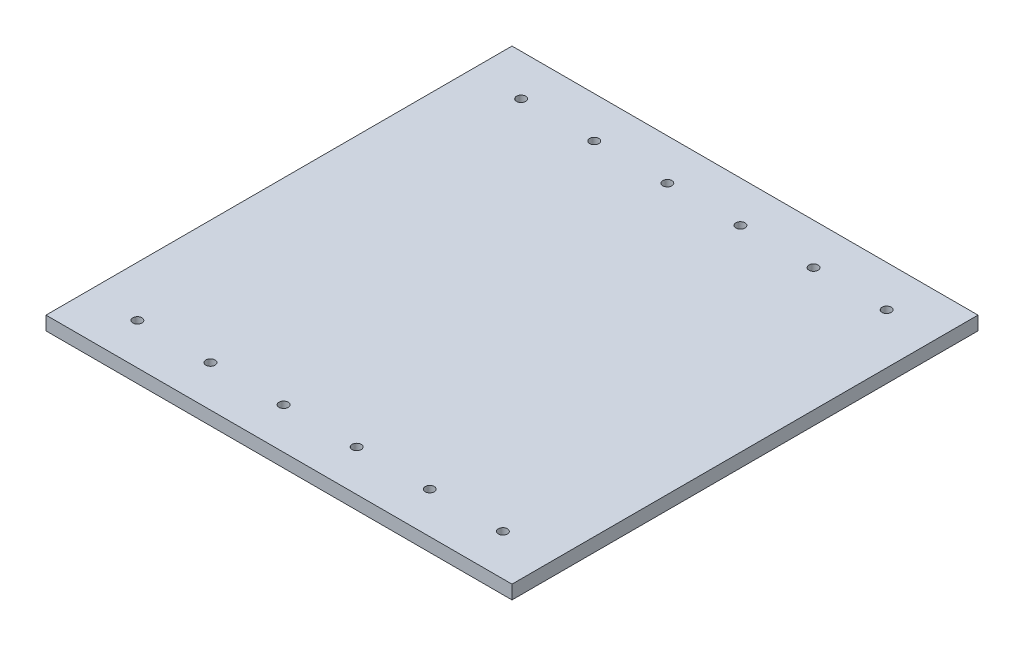
ISO-10303-21;
HEADER;
FILE_DESCRIPTION(('STEP AP214'),'2;1');
FILE_NAME('part.step','',(''),(''),'','','');
FILE_SCHEMA(('AUTOMOTIVE_DESIGN { 1 0 10303 214 1 1 1 1 }'));
ENDSEC;
DATA;
#1=APPLICATION_CONTEXT('core data for automotive mechanical design processes');
#2=APPLICATION_PROTOCOL_DEFINITION('international standard','automotive_design',2000,#1);
#3=PRODUCT_CONTEXT('',#1,'mechanical');
#4=PRODUCT('Part','Part','',(#3));
#5=PRODUCT_RELATED_PRODUCT_CATEGORY('part','',(#4));
#6=PRODUCT_DEFINITION_FORMATION('','',#4);
#7=PRODUCT_DEFINITION_CONTEXT('part definition',#1,'design');
#8=PRODUCT_DEFINITION('design','',#6,#7);
#9=PRODUCT_DEFINITION_SHAPE('','',#8);
#10=(LENGTH_UNIT() NAMED_UNIT(*) SI_UNIT(.MILLI.,.METRE.));
#11=(NAMED_UNIT(*) PLANE_ANGLE_UNIT() SI_UNIT($,.RADIAN.));
#12=(NAMED_UNIT(*) SI_UNIT($,.STERADIAN.) SOLID_ANGLE_UNIT());
#13=UNCERTAINTY_MEASURE_WITH_UNIT(LENGTH_MEASURE(1.E-05),#10,'distance_accuracy_value','');
#14=(GEOMETRIC_REPRESENTATION_CONTEXT(3) GLOBAL_UNCERTAINTY_ASSIGNED_CONTEXT((#13)) GLOBAL_UNIT_ASSIGNED_CONTEXT((#10,
#11,#12)) REPRESENTATION_CONTEXT('',''));
#15=CARTESIAN_POINT('',(0.,0.,0.));
#16=DIRECTION('',(0.,0.,1.));
#17=DIRECTION('',(1.,0.,0.));
#18=AXIS2_PLACEMENT_3D('',#15,#16,#17);
#19=CARTESIAN_POINT('',(0.,19.05,647.7));
#20=DIRECTION('',(0.,1.,0.));
#21=DIRECTION('',(0.,0.,1.));
#22=AXIS2_PLACEMENT_3D('',#19,#20,#21);
#23=PLANE('',#22);
#24=CARTESIAN_POINT('',(476.250000000006,19.05,590.55));
#25=DIRECTION('',(0.,1.,0.));
#26=DIRECTION('',(0.,0.,1.));
#27=AXIS2_PLACEMENT_3D('',#24,#25,#26);
#28=CIRCLE('',#27,6.34999999999999);
#29=CARTESIAN_POINT('',(476.250000000006,19.05,596.9));
#30=VERTEX_POINT('',#29);
#31=EDGE_CURVE('E171',#30,#30,#28,.T.);
#32=ORIENTED_EDGE('',*,*,#31,.F.);
#33=EDGE_LOOP('',(#32));
#34=FACE_BOUND('',#33,.T.);
#35=CARTESIAN_POINT('',(273.050000000006,19.05,590.55));
#36=DIRECTION('',(0.,1.,0.));
#37=DIRECTION('',(0.,0.,1.));
#38=AXIS2_PLACEMENT_3D('',#35,#36,#37);
#39=CIRCLE('',#38,6.34999999999999);
#40=CARTESIAN_POINT('',(273.050000000006,19.05,596.9));
#41=VERTEX_POINT('',#40);
#42=EDGE_CURVE('E159',#41,#41,#39,.T.);
#43=ORIENTED_EDGE('',*,*,#42,.F.);
#44=EDGE_LOOP('',(#43));
#45=FACE_BOUND('',#44,.T.);
#46=CARTESIAN_POINT('',(69.8500000000056,19.05,590.55));
#47=DIRECTION('',(0.,1.,0.));
#48=DIRECTION('',(0.,0.,1.));
#49=AXIS2_PLACEMENT_3D('',#46,#47,#48);
#50=CIRCLE('',#49,6.35000000000001);
#51=CARTESIAN_POINT('',(69.8500000000056,19.05,596.9));
#52=VERTEX_POINT('',#51);
#53=EDGE_CURVE('E147',#52,#52,#50,.T.);
#54=ORIENTED_EDGE('',*,*,#53,.F.);
#55=EDGE_LOOP('',(#54));
#56=FACE_BOUND('',#55,.T.);
#57=CARTESIAN_POINT('',(476.25,19.05,57.15));
#58=DIRECTION('',(0.,1.,0.));
#59=DIRECTION('',(0.,0.,1.));
#60=AXIS2_PLACEMENT_3D('',#57,#58,#59);
#61=CIRCLE('',#60,6.35);
#62=CARTESIAN_POINT('',(476.25,19.05,63.5));
#63=VERTEX_POINT('',#62);
#64=EDGE_CURVE('E135',#63,#63,#61,.T.);
#65=ORIENTED_EDGE('',*,*,#64,.F.);
#66=EDGE_LOOP('',(#65));
#67=FACE_BOUND('',#66,.T.);
#68=CARTESIAN_POINT('',(273.05,19.05,57.15));
#69=DIRECTION('',(0.,1.,0.));
#70=DIRECTION('',(0.,0.,1.));
#71=AXIS2_PLACEMENT_3D('',#68,#69,#70);
#72=CIRCLE('',#71,6.35);
#73=CARTESIAN_POINT('',(273.05,19.05,63.5));
#74=VERTEX_POINT('',#73);
#75=EDGE_CURVE('E123',#74,#74,#72,.T.);
#76=ORIENTED_EDGE('',*,*,#75,.F.);
#77=EDGE_LOOP('',(#76));
#78=FACE_BOUND('',#77,.T.);
#79=CARTESIAN_POINT('',(69.85,19.05,57.15));
#80=DIRECTION('',(0.,1.,0.));
#81=DIRECTION('',(0.,0.,1.));
#82=AXIS2_PLACEMENT_3D('',#79,#80,#81);
#83=CIRCLE('',#82,6.35000000000001);
#84=CARTESIAN_POINT('',(69.85,19.05,63.5));
#85=VERTEX_POINT('',#84);
#86=EDGE_CURVE('E102',#85,#85,#83,.T.);
#87=ORIENTED_EDGE('',*,*,#86,.F.);
#88=EDGE_LOOP('',(#87));
#89=FACE_BOUND('',#88,.T.);
#90=DIRECTION('',(0.,0.,1.));
#91=VECTOR('',#90,1.);
#92=CARTESIAN_POINT('',(0.,19.05,0.));
#93=LINE('',#92,#91);
#94=CARTESIAN_POINT('',(0.,19.05,0.));
#95=VERTEX_POINT('',#94);
#96=CARTESIAN_POINT('',(0.,19.05,647.7));
#97=VERTEX_POINT('',#96);
#98=EDGE_CURVE('E87',#95,#97,#93,.T.);
#99=ORIENTED_EDGE('',*,*,#98,.T.);
#100=DIRECTION('',(1.,0.,0.));
#101=VECTOR('',#100,1.);
#102=CARTESIAN_POINT('',(0.,19.05,647.7));
#103=LINE('',#102,#101);
#104=CARTESIAN_POINT('',(647.7,19.05,647.7));
#105=VERTEX_POINT('',#104);
#106=EDGE_CURVE('E82',#97,#105,#103,.T.);
#107=ORIENTED_EDGE('',*,*,#106,.T.);
#108=DIRECTION('',(0.,0.,-1.));
#109=VECTOR('',#108,1.);
#110=CARTESIAN_POINT('',(647.7,19.05,0.));
#111=LINE('',#110,#109);
#112=CARTESIAN_POINT('',(647.7,19.05,0.));
#113=VERTEX_POINT('',#112);
#114=EDGE_CURVE('E85',#105,#113,#111,.T.);
#115=ORIENTED_EDGE('',*,*,#114,.T.);
#116=DIRECTION('',(-1.,0.,0.));
#117=VECTOR('',#116,1.);
#118=CARTESIAN_POINT('',(0.,19.05,0.));
#119=LINE('',#118,#117);
#120=EDGE_CURVE('E52',#113,#95,#119,.T.);
#121=ORIENTED_EDGE('',*,*,#120,.T.);
#122=EDGE_LOOP('',(#99,#107,#115,#121));
#123=FACE_BOUND('',#122,.T.);
#124=CARTESIAN_POINT('',(171.45,19.05,57.15));
#125=DIRECTION('',(0.,1.,0.));
#126=DIRECTION('',(0.,0.,1.));
#127=AXIS2_PLACEMENT_3D('',#124,#125,#126);
#128=CIRCLE('',#127,6.35000000000002);
#129=CARTESIAN_POINT('',(171.45,19.05,63.5));
#130=VERTEX_POINT('',#129);
#131=EDGE_CURVE('E117',#130,#130,#128,.T.);
#132=ORIENTED_EDGE('',*,*,#131,.F.);
#133=EDGE_LOOP('',(#132));
#134=FACE_BOUND('',#133,.T.);
#135=CARTESIAN_POINT('',(374.65,19.05,57.15));
#136=DIRECTION('',(0.,1.,0.));
#137=DIRECTION('',(0.,0.,1.));
#138=AXIS2_PLACEMENT_3D('',#135,#136,#137);
#139=CIRCLE('',#138,6.35);
#140=CARTESIAN_POINT('',(374.65,19.05,63.5));
#141=VERTEX_POINT('',#140);
#142=EDGE_CURVE('E129',#141,#141,#139,.T.);
#143=ORIENTED_EDGE('',*,*,#142,.F.);
#144=EDGE_LOOP('',(#143));
#145=FACE_BOUND('',#144,.T.);
#146=CARTESIAN_POINT('',(577.85,19.05,57.15));
#147=DIRECTION('',(0.,1.,0.));
#148=DIRECTION('',(0.,0.,1.));
#149=AXIS2_PLACEMENT_3D('',#146,#147,#148);
#150=CIRCLE('',#149,6.35000000000005);
#151=CARTESIAN_POINT('',(577.85,19.05,63.5));
#152=VERTEX_POINT('',#151);
#153=EDGE_CURVE('E141',#152,#152,#150,.T.);
#154=ORIENTED_EDGE('',*,*,#153,.F.);
#155=EDGE_LOOP('',(#154));
#156=FACE_BOUND('',#155,.T.);
#157=CARTESIAN_POINT('',(171.450000000006,19.05,590.55));
#158=DIRECTION('',(0.,1.,0.));
#159=DIRECTION('',(0.,0.,1.));
#160=AXIS2_PLACEMENT_3D('',#157,#158,#159);
#161=CIRCLE('',#160,6.35000000000002);
#162=CARTESIAN_POINT('',(171.450000000006,19.05,596.9));
#163=VERTEX_POINT('',#162);
#164=EDGE_CURVE('E153',#163,#163,#161,.T.);
#165=ORIENTED_EDGE('',*,*,#164,.F.);
#166=EDGE_LOOP('',(#165));
#167=FACE_BOUND('',#166,.T.);
#168=CARTESIAN_POINT('',(374.650000000006,19.05,590.55));
#169=DIRECTION('',(0.,1.,0.));
#170=DIRECTION('',(0.,0.,1.));
#171=AXIS2_PLACEMENT_3D('',#168,#169,#170);
#172=CIRCLE('',#171,6.34999999999999);
#173=CARTESIAN_POINT('',(374.650000000006,19.05,596.9));
#174=VERTEX_POINT('',#173);
#175=EDGE_CURVE('E165',#174,#174,#172,.T.);
#176=ORIENTED_EDGE('',*,*,#175,.F.);
#177=EDGE_LOOP('',(#176));
#178=FACE_BOUND('',#177,.T.);
#179=CARTESIAN_POINT('',(577.850000000005,19.05,590.55));
#180=DIRECTION('',(0.,1.,0.));
#181=DIRECTION('',(0.,0.,1.));
#182=AXIS2_PLACEMENT_3D('',#179,#180,#181);
#183=CIRCLE('',#182,6.35000000000005);
#184=CARTESIAN_POINT('',(577.850000000005,19.05,596.9));
#185=VERTEX_POINT('',#184);
#186=EDGE_CURVE('E177',#185,#185,#183,.T.);
#187=ORIENTED_EDGE('',*,*,#186,.F.);
#188=EDGE_LOOP('',(#187));
#189=FACE_BOUND('',#188,.T.);
#190=ADVANCED_FACE('F35',(#34,#45,#56,#67,#78,#89,#123,#134,#145,#156,#167,#178,#189),#23,.T.);
#191=CARTESIAN_POINT('',(0.,0.,647.7));
#192=DIRECTION('',(0.,1.,0.));
#193=DIRECTION('',(0.,0.,1.));
#194=AXIS2_PLACEMENT_3D('',#191,#192,#193);
#195=PLANE('',#194);
#196=CARTESIAN_POINT('',(476.250000000006,0.,590.55));
#197=DIRECTION('',(0.,1.,0.));
#198=DIRECTION('',(0.,0.,1.));
#199=AXIS2_PLACEMENT_3D('',#196,#197,#198);
#200=CIRCLE('',#199,6.34999999999999);
#201=CARTESIAN_POINT('',(476.250000000006,0.,596.9));
#202=VERTEX_POINT('',#201);
#203=EDGE_CURVE('E174',#202,#202,#200,.T.);
#204=ORIENTED_EDGE('',*,*,#203,.T.);
#205=EDGE_LOOP('',(#204));
#206=FACE_BOUND('',#205,.T.);
#207=CARTESIAN_POINT('',(273.050000000006,0.,590.55));
#208=DIRECTION('',(0.,1.,0.));
#209=DIRECTION('',(0.,0.,1.));
#210=AXIS2_PLACEMENT_3D('',#207,#208,#209);
#211=CIRCLE('',#210,6.34999999999999);
#212=CARTESIAN_POINT('',(273.050000000006,0.,596.9));
#213=VERTEX_POINT('',#212);
#214=EDGE_CURVE('E162',#213,#213,#211,.T.);
#215=ORIENTED_EDGE('',*,*,#214,.T.);
#216=EDGE_LOOP('',(#215));
#217=FACE_BOUND('',#216,.T.);
#218=CARTESIAN_POINT('',(69.8500000000056,0.,590.55));
#219=DIRECTION('',(0.,1.,0.));
#220=DIRECTION('',(0.,0.,1.));
#221=AXIS2_PLACEMENT_3D('',#218,#219,#220);
#222=CIRCLE('',#221,6.35000000000001);
#223=CARTESIAN_POINT('',(69.8500000000056,0.,596.9));
#224=VERTEX_POINT('',#223);
#225=EDGE_CURVE('E150',#224,#224,#222,.T.);
#226=ORIENTED_EDGE('',*,*,#225,.T.);
#227=EDGE_LOOP('',(#226));
#228=FACE_BOUND('',#227,.T.);
#229=CARTESIAN_POINT('',(476.25,0.,57.15));
#230=DIRECTION('',(0.,1.,0.));
#231=DIRECTION('',(0.,0.,1.));
#232=AXIS2_PLACEMENT_3D('',#229,#230,#231);
#233=CIRCLE('',#232,6.35);
#234=CARTESIAN_POINT('',(476.25,0.,63.5));
#235=VERTEX_POINT('',#234);
#236=EDGE_CURVE('E138',#235,#235,#233,.T.);
#237=ORIENTED_EDGE('',*,*,#236,.T.);
#238=EDGE_LOOP('',(#237));
#239=FACE_BOUND('',#238,.T.);
#240=CARTESIAN_POINT('',(273.05,0.,57.15));
#241=DIRECTION('',(0.,1.,0.));
#242=DIRECTION('',(0.,0.,1.));
#243=AXIS2_PLACEMENT_3D('',#240,#241,#242);
#244=CIRCLE('',#243,6.35);
#245=CARTESIAN_POINT('',(273.05,0.,63.5));
#246=VERTEX_POINT('',#245);
#247=EDGE_CURVE('E126',#246,#246,#244,.T.);
#248=ORIENTED_EDGE('',*,*,#247,.T.);
#249=EDGE_LOOP('',(#248));
#250=FACE_BOUND('',#249,.T.);
#251=CARTESIAN_POINT('',(69.85,0.,57.15));
#252=DIRECTION('',(0.,1.,0.));
#253=DIRECTION('',(0.,0.,1.));
#254=AXIS2_PLACEMENT_3D('',#251,#252,#253);
#255=CIRCLE('',#254,6.35000000000001);
#256=CARTESIAN_POINT('',(69.85,0.,63.5));
#257=VERTEX_POINT('',#256);
#258=EDGE_CURVE('E114',#257,#257,#255,.T.);
#259=ORIENTED_EDGE('',*,*,#258,.T.);
#260=EDGE_LOOP('',(#259));
#261=FACE_BOUND('',#260,.T.);
#262=DIRECTION('',(0.,0.,1.));
#263=VECTOR('',#262,1.);
#264=CARTESIAN_POINT('',(0.,0.,0.));
#265=LINE('',#264,#263);
#266=CARTESIAN_POINT('',(0.,0.,0.));
#267=VERTEX_POINT('',#266);
#268=CARTESIAN_POINT('',(0.,0.,647.7));
#269=VERTEX_POINT('',#268);
#270=EDGE_CURVE('E99',#267,#269,#265,.T.);
#271=ORIENTED_EDGE('',*,*,#270,.F.);
#272=DIRECTION('',(-1.,0.,0.));
#273=VECTOR('',#272,1.);
#274=CARTESIAN_POINT('',(0.,0.,0.));
#275=LINE('',#274,#273);
#276=CARTESIAN_POINT('',(647.7,0.,0.));
#277=VERTEX_POINT('',#276);
#278=EDGE_CURVE('E75',#277,#267,#275,.T.);
#279=ORIENTED_EDGE('',*,*,#278,.F.);
#280=DIRECTION('',(0.,0.,-1.));
#281=VECTOR('',#280,1.);
#282=CARTESIAN_POINT('',(647.7,0.,0.));
#283=LINE('',#282,#281);
#284=CARTESIAN_POINT('',(647.7,0.,647.7));
#285=VERTEX_POINT('',#284);
#286=EDGE_CURVE('E69',#285,#277,#283,.T.);
#287=ORIENTED_EDGE('',*,*,#286,.F.);
#288=DIRECTION('',(1.,0.,0.));
#289=VECTOR('',#288,1.);
#290=CARTESIAN_POINT('',(0.,0.,647.7));
#291=LINE('',#290,#289);
#292=EDGE_CURVE('E91',#269,#285,#291,.T.);
#293=ORIENTED_EDGE('',*,*,#292,.F.);
#294=EDGE_LOOP('',(#271,#279,#287,#293));
#295=FACE_BOUND('',#294,.T.);
#296=CARTESIAN_POINT('',(171.45,0.,57.15));
#297=DIRECTION('',(0.,1.,0.));
#298=DIRECTION('',(0.,0.,1.));
#299=AXIS2_PLACEMENT_3D('',#296,#297,#298);
#300=CIRCLE('',#299,6.35000000000002);
#301=CARTESIAN_POINT('',(171.45,0.,63.5));
#302=VERTEX_POINT('',#301);
#303=EDGE_CURVE('E120',#302,#302,#300,.T.);
#304=ORIENTED_EDGE('',*,*,#303,.T.);
#305=EDGE_LOOP('',(#304));
#306=FACE_BOUND('',#305,.T.);
#307=CARTESIAN_POINT('',(374.65,0.,57.15));
#308=DIRECTION('',(0.,1.,0.));
#309=DIRECTION('',(0.,0.,1.));
#310=AXIS2_PLACEMENT_3D('',#307,#308,#309);
#311=CIRCLE('',#310,6.35);
#312=CARTESIAN_POINT('',(374.65,0.,63.5));
#313=VERTEX_POINT('',#312);
#314=EDGE_CURVE('E132',#313,#313,#311,.T.);
#315=ORIENTED_EDGE('',*,*,#314,.T.);
#316=EDGE_LOOP('',(#315));
#317=FACE_BOUND('',#316,.T.);
#318=CARTESIAN_POINT('',(577.85,0.,57.15));
#319=DIRECTION('',(0.,1.,0.));
#320=DIRECTION('',(0.,0.,1.));
#321=AXIS2_PLACEMENT_3D('',#318,#319,#320);
#322=CIRCLE('',#321,6.35000000000005);
#323=CARTESIAN_POINT('',(577.85,0.,63.5));
#324=VERTEX_POINT('',#323);
#325=EDGE_CURVE('E144',#324,#324,#322,.T.);
#326=ORIENTED_EDGE('',*,*,#325,.T.);
#327=EDGE_LOOP('',(#326));
#328=FACE_BOUND('',#327,.T.);
#329=CARTESIAN_POINT('',(171.450000000006,0.,590.55));
#330=DIRECTION('',(0.,1.,0.));
#331=DIRECTION('',(0.,0.,1.));
#332=AXIS2_PLACEMENT_3D('',#329,#330,#331);
#333=CIRCLE('',#332,6.35000000000002);
#334=CARTESIAN_POINT('',(171.450000000006,0.,596.9));
#335=VERTEX_POINT('',#334);
#336=EDGE_CURVE('E156',#335,#335,#333,.T.);
#337=ORIENTED_EDGE('',*,*,#336,.T.);
#338=EDGE_LOOP('',(#337));
#339=FACE_BOUND('',#338,.T.);
#340=CARTESIAN_POINT('',(374.650000000006,0.,590.55));
#341=DIRECTION('',(0.,1.,0.));
#342=DIRECTION('',(0.,0.,1.));
#343=AXIS2_PLACEMENT_3D('',#340,#341,#342);
#344=CIRCLE('',#343,6.34999999999999);
#345=CARTESIAN_POINT('',(374.650000000006,0.,596.9));
#346=VERTEX_POINT('',#345);
#347=EDGE_CURVE('E168',#346,#346,#344,.T.);
#348=ORIENTED_EDGE('',*,*,#347,.T.);
#349=EDGE_LOOP('',(#348));
#350=FACE_BOUND('',#349,.T.);
#351=CARTESIAN_POINT('',(577.850000000005,0.,590.55));
#352=DIRECTION('',(0.,1.,0.));
#353=DIRECTION('',(0.,0.,1.));
#354=AXIS2_PLACEMENT_3D('',#351,#352,#353);
#355=CIRCLE('',#354,6.35000000000005);
#356=CARTESIAN_POINT('',(577.850000000005,0.,596.9));
#357=VERTEX_POINT('',#356);
#358=EDGE_CURVE('E180',#357,#357,#355,.T.);
#359=ORIENTED_EDGE('',*,*,#358,.T.);
#360=EDGE_LOOP('',(#359));
#361=FACE_BOUND('',#360,.T.);
#362=ADVANCED_FACE('F110',(#206,#217,#228,#239,#250,#261,#295,#306,#317,#328,#339,#350,#361),
#195,.F.);
#363=CARTESIAN_POINT('',(0.,19.05,0.));
#364=DIRECTION('',(1.,0.,0.));
#365=DIRECTION('',(0.,0.,-1.));
#366=AXIS2_PLACEMENT_3D('',#363,#364,#365);
#367=PLANE('',#366);
#368=ORIENTED_EDGE('',*,*,#270,.T.);
#369=DIRECTION('',(0.,-1.,0.));
#370=VECTOR('',#369,1.);
#371=CARTESIAN_POINT('',(0.,19.05,647.7));
#372=LINE('',#371,#370);
#373=EDGE_CURVE('E11',#97,#269,#372,.T.);
#374=ORIENTED_EDGE('',*,*,#373,.F.);
#375=ORIENTED_EDGE('',*,*,#98,.F.);
#376=DIRECTION('',(0.,-1.,0.));
#377=VECTOR('',#376,1.);
#378=CARTESIAN_POINT('',(0.,19.05,0.));
#379=LINE('',#378,#377);
#380=EDGE_CURVE('E95',#95,#267,#379,.T.);
#381=ORIENTED_EDGE('',*,*,#380,.T.);
#382=EDGE_LOOP('',(#368,#374,#375,#381));
#383=FACE_BOUND('',#382,.T.);
#384=ADVANCED_FACE('F37',(#383),#367,.F.);
#385=CARTESIAN_POINT('',(0.,19.05,647.7));
#386=DIRECTION('',(0.,0.,-1.));
#387=DIRECTION('',(-1.,0.,0.));
#388=AXIS2_PLACEMENT_3D('',#385,#386,#387);
#389=PLANE('',#388);
#390=ORIENTED_EDGE('',*,*,#292,.T.);
#391=DIRECTION('',(0.,-1.,0.));
#392=VECTOR('',#391,1.);
#393=CARTESIAN_POINT('',(647.7,19.05,647.7));
#394=LINE('',#393,#392);
#395=EDGE_CURVE('E44',#105,#285,#394,.T.);
#396=ORIENTED_EDGE('',*,*,#395,.F.);
#397=ORIENTED_EDGE('',*,*,#106,.F.);
#398=ORIENTED_EDGE('',*,*,#373,.T.);
#399=EDGE_LOOP('',(#390,#396,#397,#398));
#400=FACE_BOUND('',#399,.T.);
#401=ADVANCED_FACE('F90',(#400),#389,.F.);
#402=CARTESIAN_POINT('',(647.7,19.05,0.));
#403=DIRECTION('',(-1.,0.,0.));
#404=DIRECTION('',(0.,0.,1.));
#405=AXIS2_PLACEMENT_3D('',#402,#403,#404);
#406=PLANE('',#405);
#407=ORIENTED_EDGE('',*,*,#286,.T.);
#408=DIRECTION('',(0.,-1.,0.));
#409=VECTOR('',#408,1.);
#410=CARTESIAN_POINT('',(647.7,19.05,0.));
#411=LINE('',#410,#409);
#412=EDGE_CURVE('E92',#113,#277,#411,.T.);
#413=ORIENTED_EDGE('',*,*,#412,.F.);
#414=ORIENTED_EDGE('',*,*,#114,.F.);
#415=ORIENTED_EDGE('',*,*,#395,.T.);
#416=EDGE_LOOP('',(#407,#413,#414,#415));
#417=FACE_BOUND('',#416,.T.);
#418=ADVANCED_FACE('F93',(#417),#406,.F.);
#419=CARTESIAN_POINT('',(0.,19.05,0.));
#420=DIRECTION('',(0.,0.,1.));
#421=DIRECTION('',(1.,0.,0.));
#422=AXIS2_PLACEMENT_3D('',#419,#420,#421);
#423=PLANE('',#422);
#424=ORIENTED_EDGE('',*,*,#278,.T.);
#425=ORIENTED_EDGE('',*,*,#380,.F.);
#426=ORIENTED_EDGE('',*,*,#120,.F.);
#427=ORIENTED_EDGE('',*,*,#412,.T.);
#428=EDGE_LOOP('',(#424,#425,#426,#427));
#429=FACE_BOUND('',#428,.T.);
#430=ADVANCED_FACE('F107',(#429),#423,.F.);
#431=CARTESIAN_POINT('',(69.85,19.05,57.15));
#432=DIRECTION('',(0.,-1.,0.));
#433=DIRECTION('',(0.,0.,-1.));
#434=AXIS2_PLACEMENT_3D('',#431,#432,#433);
#435=CYLINDRICAL_SURFACE('',#434,6.35000000000001);
#436=ORIENTED_EDGE('',*,*,#86,.T.);
#437=EDGE_LOOP('',(#436));
#438=FACE_BOUND('',#437,.T.);
#439=ORIENTED_EDGE('',*,*,#258,.F.);
#440=EDGE_LOOP('',(#439));
#441=FACE_BOUND('',#440,.T.);
#442=ADVANCED_FACE('F200',(#438,#441),#435,.F.);
#443=CARTESIAN_POINT('',(171.45,19.05,57.15));
#444=DIRECTION('',(0.,-1.,0.));
#445=DIRECTION('',(0.,0.,-1.));
#446=AXIS2_PLACEMENT_3D('',#443,#444,#445);
#447=CYLINDRICAL_SURFACE('',#446,6.35000000000002);
#448=ORIENTED_EDGE('',*,*,#131,.T.);
#449=EDGE_LOOP('',(#448));
#450=FACE_BOUND('',#449,.T.);
#451=ORIENTED_EDGE('',*,*,#303,.F.);
#452=EDGE_LOOP('',(#451));
#453=FACE_BOUND('',#452,.T.);
#454=ADVANCED_FACE('F246',(#450,#453),#447,.F.);
#455=CARTESIAN_POINT('',(273.05,19.05,57.15));
#456=DIRECTION('',(0.,-1.,0.));
#457=DIRECTION('',(0.,0.,-1.));
#458=AXIS2_PLACEMENT_3D('',#455,#456,#457);
#459=CYLINDRICAL_SURFACE('',#458,6.35);
#460=ORIENTED_EDGE('',*,*,#75,.T.);
#461=EDGE_LOOP('',(#460));
#462=FACE_BOUND('',#461,.T.);
#463=ORIENTED_EDGE('',*,*,#247,.F.);
#464=EDGE_LOOP('',(#463));
#465=FACE_BOUND('',#464,.T.);
#466=ADVANCED_FACE('F254',(#462,#465),#459,.F.);
#467=CARTESIAN_POINT('',(374.65,19.05,57.15));
#468=DIRECTION('',(0.,-1.,0.));
#469=DIRECTION('',(0.,0.,-1.));
#470=AXIS2_PLACEMENT_3D('',#467,#468,#469);
#471=CYLINDRICAL_SURFACE('',#470,6.35);
#472=ORIENTED_EDGE('',*,*,#142,.T.);
#473=EDGE_LOOP('',(#472));
#474=FACE_BOUND('',#473,.T.);
#475=ORIENTED_EDGE('',*,*,#314,.F.);
#476=EDGE_LOOP('',(#475));
#477=FACE_BOUND('',#476,.T.);
#478=ADVANCED_FACE('F262',(#474,#477),#471,.F.);
#479=CARTESIAN_POINT('',(476.25,19.05,57.15));
#480=DIRECTION('',(0.,-1.,0.));
#481=DIRECTION('',(0.,0.,-1.));
#482=AXIS2_PLACEMENT_3D('',#479,#480,#481);
#483=CYLINDRICAL_SURFACE('',#482,6.35);
#484=ORIENTED_EDGE('',*,*,#64,.T.);
#485=EDGE_LOOP('',(#484));
#486=FACE_BOUND('',#485,.T.);
#487=ORIENTED_EDGE('',*,*,#236,.F.);
#488=EDGE_LOOP('',(#487));
#489=FACE_BOUND('',#488,.T.);
#490=ADVANCED_FACE('F271',(#486,#489),#483,.F.);
#491=CARTESIAN_POINT('',(577.85,19.05,57.15));
#492=DIRECTION('',(0.,-1.,0.));
#493=DIRECTION('',(0.,0.,-1.));
#494=AXIS2_PLACEMENT_3D('',#491,#492,#493);
#495=CYLINDRICAL_SURFACE('',#494,6.35000000000005);
#496=ORIENTED_EDGE('',*,*,#153,.T.);
#497=EDGE_LOOP('',(#496));
#498=FACE_BOUND('',#497,.T.);
#499=ORIENTED_EDGE('',*,*,#325,.F.);
#500=EDGE_LOOP('',(#499));
#501=FACE_BOUND('',#500,.T.);
#502=ADVANCED_FACE('F280',(#498,#501),#495,.F.);
#503=CARTESIAN_POINT('',(69.8500000000056,19.05,590.55));
#504=DIRECTION('',(0.,-1.,0.));
#505=DIRECTION('',(0.,0.,-1.));
#506=AXIS2_PLACEMENT_3D('',#503,#504,#505);
#507=CYLINDRICAL_SURFACE('',#506,6.35000000000001);
#508=ORIENTED_EDGE('',*,*,#53,.T.);
#509=EDGE_LOOP('',(#508));
#510=FACE_BOUND('',#509,.T.);
#511=ORIENTED_EDGE('',*,*,#225,.F.);
#512=EDGE_LOOP('',(#511));
#513=FACE_BOUND('',#512,.T.);
#514=ADVANCED_FACE('F289',(#510,#513),#507,.F.);
#515=CARTESIAN_POINT('',(171.450000000006,19.05,590.55));
#516=DIRECTION('',(0.,-1.,0.));
#517=DIRECTION('',(0.,0.,-1.));
#518=AXIS2_PLACEMENT_3D('',#515,#516,#517);
#519=CYLINDRICAL_SURFACE('',#518,6.35000000000002);
#520=ORIENTED_EDGE('',*,*,#164,.T.);
#521=EDGE_LOOP('',(#520));
#522=FACE_BOUND('',#521,.T.);
#523=ORIENTED_EDGE('',*,*,#336,.F.);
#524=EDGE_LOOP('',(#523));
#525=FACE_BOUND('',#524,.T.);
#526=ADVANCED_FACE('F298',(#522,#525),#519,.F.);
#527=CARTESIAN_POINT('',(273.050000000006,19.05,590.55));
#528=DIRECTION('',(0.,-1.,0.));
#529=DIRECTION('',(0.,0.,-1.));
#530=AXIS2_PLACEMENT_3D('',#527,#528,#529);
#531=CYLINDRICAL_SURFACE('',#530,6.34999999999999);
#532=ORIENTED_EDGE('',*,*,#42,.T.);
#533=EDGE_LOOP('',(#532));
#534=FACE_BOUND('',#533,.T.);
#535=ORIENTED_EDGE('',*,*,#214,.F.);
#536=EDGE_LOOP('',(#535));
#537=FACE_BOUND('',#536,.T.);
#538=ADVANCED_FACE('F307',(#534,#537),#531,.F.);
#539=CARTESIAN_POINT('',(374.650000000006,19.05,590.55));
#540=DIRECTION('',(0.,-1.,0.));
#541=DIRECTION('',(0.,0.,-1.));
#542=AXIS2_PLACEMENT_3D('',#539,#540,#541);
#543=CYLINDRICAL_SURFACE('',#542,6.34999999999999);
#544=ORIENTED_EDGE('',*,*,#175,.T.);
#545=EDGE_LOOP('',(#544));
#546=FACE_BOUND('',#545,.T.);
#547=ORIENTED_EDGE('',*,*,#347,.F.);
#548=EDGE_LOOP('',(#547));
#549=FACE_BOUND('',#548,.T.);
#550=ADVANCED_FACE('F316',(#546,#549),#543,.F.);
#551=CARTESIAN_POINT('',(476.250000000006,19.05,590.55));
#552=DIRECTION('',(0.,-1.,0.));
#553=DIRECTION('',(0.,0.,-1.));
#554=AXIS2_PLACEMENT_3D('',#551,#552,#553);
#555=CYLINDRICAL_SURFACE('',#554,6.34999999999999);
#556=ORIENTED_EDGE('',*,*,#31,.T.);
#557=EDGE_LOOP('',(#556));
#558=FACE_BOUND('',#557,.T.);
#559=ORIENTED_EDGE('',*,*,#203,.F.);
#560=EDGE_LOOP('',(#559));
#561=FACE_BOUND('',#560,.T.);
#562=ADVANCED_FACE('F325',(#558,#561),#555,.F.);
#563=CARTESIAN_POINT('',(577.850000000005,19.05,590.55));
#564=DIRECTION('',(0.,-1.,0.));
#565=DIRECTION('',(0.,0.,-1.));
#566=AXIS2_PLACEMENT_3D('',#563,#564,#565);
#567=CYLINDRICAL_SURFACE('',#566,6.35000000000005);
#568=ORIENTED_EDGE('',*,*,#186,.T.);
#569=EDGE_LOOP('',(#568));
#570=FACE_BOUND('',#569,.T.);
#571=ORIENTED_EDGE('',*,*,#358,.F.);
#572=EDGE_LOOP('',(#571));
#573=FACE_BOUND('',#572,.T.);
#574=ADVANCED_FACE('F186',(#570,#573),#567,.F.);
#575=CLOSED_SHELL('',(#190,#362,#384,#401,#418,#430,#442,#454,#466,#478,#490,#502,#514,#526,
#538,#550,#562,#574));
#576=MANIFOLD_SOLID_BREP('B2',#575);
#577=ADVANCED_BREP_SHAPE_REPRESENTATION('',(#18,#576),#14);
#578=SHAPE_DEFINITION_REPRESENTATION(#9,#577);
ENDSEC;
END-ISO-10303-21;
